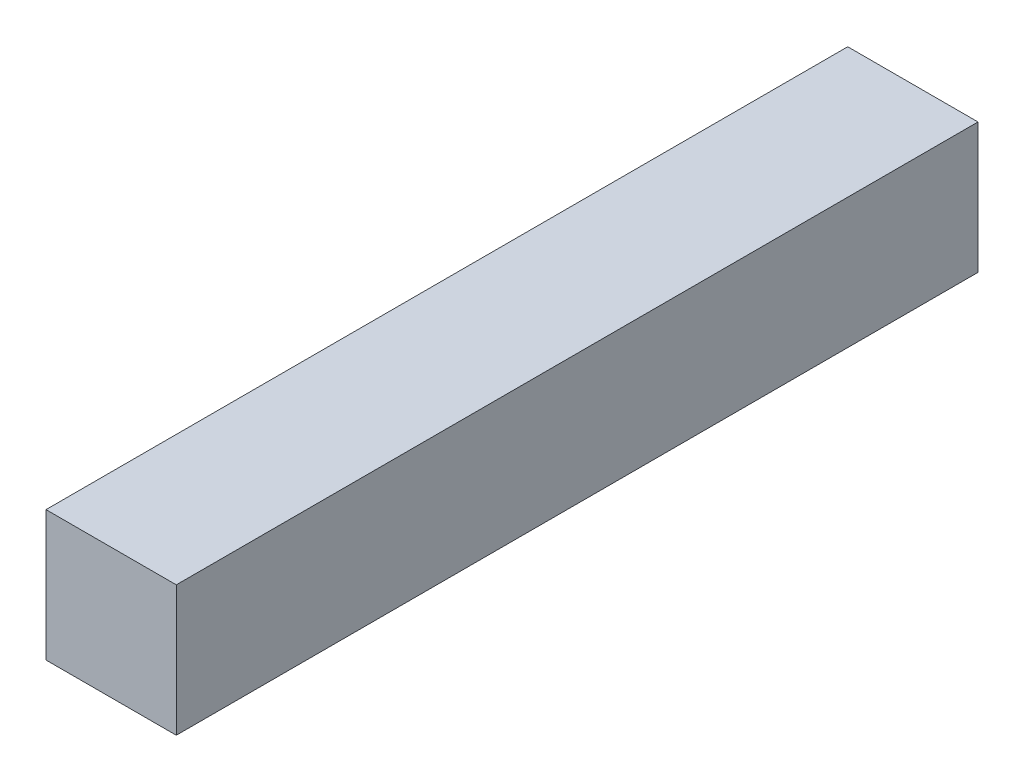
ISO-10303-21;
HEADER;
FILE_DESCRIPTION(('STEP AP214'),'2;1');
FILE_NAME('part.step','',(''),(''),'','','');
FILE_SCHEMA(('AUTOMOTIVE_DESIGN { 1 0 10303 214 1 1 1 1 }'));
ENDSEC;
DATA;
#1=APPLICATION_CONTEXT('core data for automotive mechanical design processes');
#2=APPLICATION_PROTOCOL_DEFINITION('international standard','automotive_design',2000,#1);
#3=PRODUCT_CONTEXT('',#1,'mechanical');
#4=PRODUCT('Part','Part','',(#3));
#5=PRODUCT_RELATED_PRODUCT_CATEGORY('part','',(#4));
#6=PRODUCT_DEFINITION_FORMATION('','',#4);
#7=PRODUCT_DEFINITION_CONTEXT('part definition',#1,'design');
#8=PRODUCT_DEFINITION('design','',#6,#7);
#9=PRODUCT_DEFINITION_SHAPE('','',#8);
#10=(LENGTH_UNIT() NAMED_UNIT(*) SI_UNIT(.MILLI.,.METRE.));
#11=(NAMED_UNIT(*) PLANE_ANGLE_UNIT() SI_UNIT($,.RADIAN.));
#12=(NAMED_UNIT(*) SI_UNIT($,.STERADIAN.) SOLID_ANGLE_UNIT());
#13=UNCERTAINTY_MEASURE_WITH_UNIT(LENGTH_MEASURE(1.E-05),#10,'distance_accuracy_value','');
#14=(GEOMETRIC_REPRESENTATION_CONTEXT(3) GLOBAL_UNCERTAINTY_ASSIGNED_CONTEXT((#13)) GLOBAL_UNIT_ASSIGNED_CONTEXT((#10,
#11,#12)) REPRESENTATION_CONTEXT('',''));
#15=CARTESIAN_POINT('',(0.,0.,0.));
#16=DIRECTION('',(0.,0.,1.));
#17=DIRECTION('',(1.,0.,0.));
#18=AXIS2_PLACEMENT_3D('',#15,#16,#17);
#19=CARTESIAN_POINT('',(0.,0.,400.));
#20=DIRECTION('',(1.,0.,0.));
#21=DIRECTION('',(0.,0.,-1.));
#22=AXIS2_PLACEMENT_3D('',#19,#20,#21);
#23=PLANE('',#22);
#24=DIRECTION('',(0.,-1.,0.));
#25=VECTOR('',#24,1.);
#26=CARTESIAN_POINT('',(0.,0.,0.));
#27=LINE('',#26,#25);
#28=CARTESIAN_POINT('',(0.,65.,0.));
#29=VERTEX_POINT('',#28);
#30=CARTESIAN_POINT('',(0.,0.,0.));
#31=VERTEX_POINT('',#30);
#32=EDGE_CURVE('E96',#29,#31,#27,.T.);
#33=ORIENTED_EDGE('',*,*,#32,.T.);
#34=DIRECTION('',(0.,0.,-1.));
#35=VECTOR('',#34,1.);
#36=CARTESIAN_POINT('',(0.,0.,400.));
#37=LINE('',#36,#35);
#38=CARTESIAN_POINT('',(0.,0.,400.));
#39=VERTEX_POINT('',#38);
#40=EDGE_CURVE('E11',#39,#31,#37,.T.);
#41=ORIENTED_EDGE('',*,*,#40,.F.);
#42=DIRECTION('',(0.,-1.,0.));
#43=VECTOR('',#42,1.);
#44=CARTESIAN_POINT('',(0.,0.,400.));
#45=LINE('',#44,#43);
#46=CARTESIAN_POINT('',(0.,65.,400.));
#47=VERTEX_POINT('',#46);
#48=EDGE_CURVE('E84',#47,#39,#45,.T.);
#49=ORIENTED_EDGE('',*,*,#48,.F.);
#50=DIRECTION('',(0.,0.,-1.));
#51=VECTOR('',#50,1.);
#52=CARTESIAN_POINT('',(0.,65.,400.));
#53=LINE('',#52,#51);
#54=EDGE_CURVE('E92',#47,#29,#53,.T.);
#55=ORIENTED_EDGE('',*,*,#54,.T.);
#56=EDGE_LOOP('',(#33,#41,#49,#55));
#57=FACE_BOUND('',#56,.T.);
#58=ADVANCED_FACE('F33',(#57),#23,.F.);
#59=CARTESIAN_POINT('',(0.,0.,400.));
#60=DIRECTION('',(0.,1.,0.));
#61=DIRECTION('',(0.,0.,1.));
#62=AXIS2_PLACEMENT_3D('',#59,#60,#61);
#63=PLANE('',#62);
#64=DIRECTION('',(1.,0.,0.));
#65=VECTOR('',#64,1.);
#66=CARTESIAN_POINT('',(0.,0.,0.));
#67=LINE('',#66,#65);
#68=CARTESIAN_POINT('',(65.,0.,0.));
#69=VERTEX_POINT('',#68);
#70=EDGE_CURVE('E88',#31,#69,#67,.T.);
#71=ORIENTED_EDGE('',*,*,#70,.T.);
#72=DIRECTION('',(0.,0.,-1.));
#73=VECTOR('',#72,1.);
#74=CARTESIAN_POINT('',(65.,0.,400.));
#75=LINE('',#74,#73);
#76=CARTESIAN_POINT('',(65.,0.,400.));
#77=VERTEX_POINT('',#76);
#78=EDGE_CURVE('E41',#77,#69,#75,.T.);
#79=ORIENTED_EDGE('',*,*,#78,.F.);
#80=DIRECTION('',(1.,0.,0.));
#81=VECTOR('',#80,1.);
#82=CARTESIAN_POINT('',(0.,0.,400.));
#83=LINE('',#82,#81);
#84=EDGE_CURVE('E79',#39,#77,#83,.T.);
#85=ORIENTED_EDGE('',*,*,#84,.F.);
#86=ORIENTED_EDGE('',*,*,#40,.T.);
#87=EDGE_LOOP('',(#71,#79,#85,#86));
#88=FACE_BOUND('',#87,.T.);
#89=ADVANCED_FACE('F87',(#88),#63,.F.);
#90=CARTESIAN_POINT('',(65.,0.,400.));
#91=DIRECTION('',(-1.,0.,0.));
#92=DIRECTION('',(0.,0.,1.));
#93=AXIS2_PLACEMENT_3D('',#90,#91,#92);
#94=PLANE('',#93);
#95=DIRECTION('',(0.,1.,0.));
#96=VECTOR('',#95,1.);
#97=CARTESIAN_POINT('',(65.,0.,0.));
#98=LINE('',#97,#96);
#99=CARTESIAN_POINT('',(65.,65.,0.));
#100=VERTEX_POINT('',#99);
#101=EDGE_CURVE('E66',#69,#100,#98,.T.);
#102=ORIENTED_EDGE('',*,*,#101,.T.);
#103=DIRECTION('',(0.,0.,-1.));
#104=VECTOR('',#103,1.);
#105=CARTESIAN_POINT('',(65.,65.,400.));
#106=LINE('',#105,#104);
#107=CARTESIAN_POINT('',(65.,65.,400.));
#108=VERTEX_POINT('',#107);
#109=EDGE_CURVE('E89',#108,#100,#106,.T.);
#110=ORIENTED_EDGE('',*,*,#109,.F.);
#111=DIRECTION('',(0.,1.,0.));
#112=VECTOR('',#111,1.);
#113=CARTESIAN_POINT('',(65.,0.,400.));
#114=LINE('',#113,#112);
#115=EDGE_CURVE('E82',#77,#108,#114,.T.);
#116=ORIENTED_EDGE('',*,*,#115,.F.);
#117=ORIENTED_EDGE('',*,*,#78,.T.);
#118=EDGE_LOOP('',(#102,#110,#116,#117));
#119=FACE_BOUND('',#118,.T.);
#120=ADVANCED_FACE('F90',(#119),#94,.F.);
#121=CARTESIAN_POINT('',(0.,65.,400.));
#122=DIRECTION('',(0.,-1.,0.));
#123=DIRECTION('',(0.,0.,-1.));
#124=AXIS2_PLACEMENT_3D('',#121,#122,#123);
#125=PLANE('',#124);
#126=DIRECTION('',(-1.,0.,0.));
#127=VECTOR('',#126,1.);
#128=CARTESIAN_POINT('',(0.,65.,0.));
#129=LINE('',#128,#127);
#130=EDGE_CURVE('E72',#100,#29,#129,.T.);
#131=ORIENTED_EDGE('',*,*,#130,.T.);
#132=ORIENTED_EDGE('',*,*,#54,.F.);
#133=DIRECTION('',(-1.,0.,0.));
#134=VECTOR('',#133,1.);
#135=CARTESIAN_POINT('',(0.,65.,400.));
#136=LINE('',#135,#134);
#137=EDGE_CURVE('E49',#108,#47,#136,.T.);
#138=ORIENTED_EDGE('',*,*,#137,.F.);
#139=ORIENTED_EDGE('',*,*,#109,.T.);
#140=EDGE_LOOP('',(#131,#132,#138,#139));
#141=FACE_BOUND('',#140,.T.);
#142=ADVANCED_FACE('F103',(#141),#125,.F.);
#143=CARTESIAN_POINT('',(0.,0.,400.));
#144=DIRECTION('',(0.,0.,-1.));
#145=DIRECTION('',(-1.,0.,0.));
#146=AXIS2_PLACEMENT_3D('',#143,#144,#145);
#147=PLANE('',#146);
#148=ORIENTED_EDGE('',*,*,#48,.T.);
#149=ORIENTED_EDGE('',*,*,#84,.T.);
#150=ORIENTED_EDGE('',*,*,#115,.T.);
#151=ORIENTED_EDGE('',*,*,#137,.T.);
#152=EDGE_LOOP('',(#148,#149,#150,#151));
#153=FACE_BOUND('',#152,.T.);
#154=ADVANCED_FACE('F80',(#153),#147,.F.);
#155=CARTESIAN_POINT('',(0.,0.,0.));
#156=DIRECTION('',(0.,0.,-1.));
#157=DIRECTION('',(-1.,0.,0.));
#158=AXIS2_PLACEMENT_3D('',#155,#156,#157);
#159=PLANE('',#158);
#160=ORIENTED_EDGE('',*,*,#32,.F.);
#161=ORIENTED_EDGE('',*,*,#130,.F.);
#162=ORIENTED_EDGE('',*,*,#101,.F.);
#163=ORIENTED_EDGE('',*,*,#70,.F.);
#164=EDGE_LOOP('',(#160,#161,#162,#163));
#165=FACE_BOUND('',#164,.T.);
#166=ADVANCED_FACE('F106',(#165),#159,.T.);
#167=CLOSED_SHELL('',(#58,#89,#120,#142,#154,#166));
#168=MANIFOLD_SOLID_BREP('B2',#167);
#169=ADVANCED_BREP_SHAPE_REPRESENTATION('',(#18,#168),#14);
#170=SHAPE_DEFINITION_REPRESENTATION(#9,#169);
ENDSEC;
END-ISO-10303-21;
